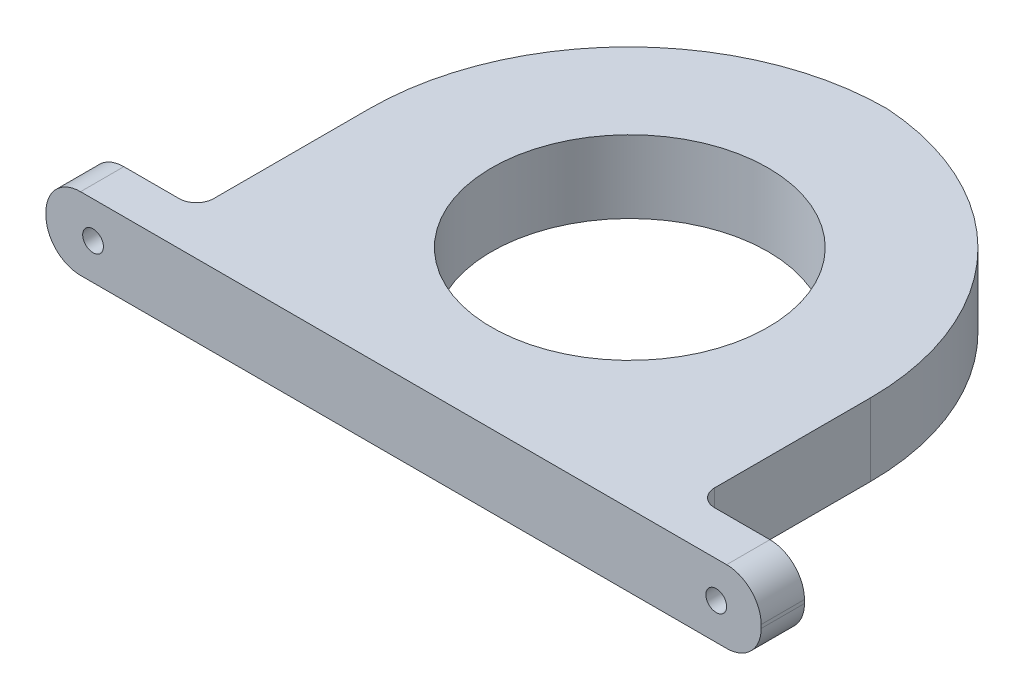
ISO-10303-21;
HEADER;
FILE_DESCRIPTION(('STEP AP214'),'2;1');
FILE_NAME('part.step','',(''),(''),'','','');
FILE_SCHEMA(('AUTOMOTIVE_DESIGN { 1 0 10303 214 1 1 1 1 }'));
ENDSEC;
DATA;
#1=APPLICATION_CONTEXT('core data for automotive mechanical design processes');
#2=APPLICATION_PROTOCOL_DEFINITION('international standard','automotive_design',2000,#1);
#3=PRODUCT_CONTEXT('',#1,'mechanical');
#4=PRODUCT('Part','Part','',(#3));
#5=PRODUCT_RELATED_PRODUCT_CATEGORY('part','',(#4));
#6=PRODUCT_DEFINITION_FORMATION('','',#4);
#7=PRODUCT_DEFINITION_CONTEXT('part definition',#1,'design');
#8=PRODUCT_DEFINITION('design','',#6,#7);
#9=PRODUCT_DEFINITION_SHAPE('','',#8);
#10=(LENGTH_UNIT() NAMED_UNIT(*) SI_UNIT(.MILLI.,.METRE.));
#11=(NAMED_UNIT(*) PLANE_ANGLE_UNIT() SI_UNIT($,.RADIAN.));
#12=(NAMED_UNIT(*) SI_UNIT($,.STERADIAN.) SOLID_ANGLE_UNIT());
#13=UNCERTAINTY_MEASURE_WITH_UNIT(LENGTH_MEASURE(1.E-05),#10,'distance_accuracy_value','');
#14=(GEOMETRIC_REPRESENTATION_CONTEXT(3) GLOBAL_UNCERTAINTY_ASSIGNED_CONTEXT((#13)) GLOBAL_UNIT_ASSIGNED_CONTEXT((#10,
#11,#12)) REPRESENTATION_CONTEXT('',''));
#15=CARTESIAN_POINT('',(0.,0.,0.));
#16=DIRECTION('',(0.,0.,1.));
#17=DIRECTION('',(1.,0.,0.));
#18=AXIS2_PLACEMENT_3D('',#15,#16,#17);
#19=CARTESIAN_POINT('',(0.,21.,0.));
#20=DIRECTION('',(0.,1.,0.));
#21=DIRECTION('',(0.,0.,1.));
#22=AXIS2_PLACEMENT_3D('',#19,#20,#21);
#23=PLANE('',#22);
#24=DIRECTION('',(0.,0.,-1.));
#25=VECTOR('',#24,1.);
#26=CARTESIAN_POINT('',(72.1911502974414,21.,40.));
#27=LINE('',#26,#25);
#28=CARTESIAN_POINT('',(72.1911502974414,21.,35.));
#29=VERTEX_POINT('',#28);
#30=CARTESIAN_POINT('',(72.1911502974414,21.,-10.1668522645212));
#31=VERTEX_POINT('',#30);
#32=EDGE_CURVE('E264',#29,#31,#27,.T.);
#33=ORIENTED_EDGE('',*,*,#32,.T.);
#34=CARTESIAN_POINT('',(-2.80884970255862,21.,-10.1668522645212));
#35=DIRECTION('',(0.,1.,0.));
#36=DIRECTION('',(0.,0.,1.));
#37=AXIS2_PLACEMENT_3D('',#34,#35,#36);
#38=CIRCLE('',#37,75.);
#39=CARTESIAN_POINT('',(2.19115029744135,21.,-85.));
#40=VERTEX_POINT('',#39);
#41=EDGE_CURVE('E11',#31,#40,#38,.T.);
#42=ORIENTED_EDGE('',*,*,#41,.T.);
#43=CARTESIAN_POINT('',(2.19115029744135,21.,-10.));
#44=DIRECTION('',(0.,1.,0.));
#45=DIRECTION('',(0.,0.,1.));
#46=AXIS2_PLACEMENT_3D('',#43,#44,#45);
#47=CIRCLE('',#46,75.);
#48=CARTESIAN_POINT('',(-72.8088497025586,21.,-10.));
#49=VERTEX_POINT('',#48);
#50=EDGE_CURVE('E234',#40,#49,#47,.T.);
#51=ORIENTED_EDGE('',*,*,#50,.T.);
#52=DIRECTION('',(0.,0.,1.));
#53=VECTOR('',#52,1.);
#54=CARTESIAN_POINT('',(-72.8088497025586,21.,40.));
#55=LINE('',#54,#53);
#56=CARTESIAN_POINT('',(-72.8088497025586,21.,35.));
#57=VERTEX_POINT('',#56);
#58=EDGE_CURVE('E238',#49,#57,#55,.T.);
#59=ORIENTED_EDGE('',*,*,#58,.T.);
#60=CARTESIAN_POINT('',(-77.8088497025586,21.,35.));
#61=DIRECTION('',(0.,1.,0.));
#62=DIRECTION('',(0.,0.,1.));
#63=AXIS2_PLACEMENT_3D('',#60,#61,#62);
#64=CIRCLE('',#63,5.);
#65=CARTESIAN_POINT('',(-77.8088497025586,21.,40.));
#66=VERTEX_POINT('',#65);
#67=EDGE_CURVE('E224',#57,#66,#64,.F.);
#68=ORIENTED_EDGE('',*,*,#67,.T.);
#69=DIRECTION('',(-1.,0.,0.));
#70=VECTOR('',#69,1.);
#71=CARTESIAN_POINT('',(-103.808849702559,21.,40.));
#72=LINE('',#71,#70);
#73=CARTESIAN_POINT('',(-93.8088497025586,21.,40.));
#74=VERTEX_POINT('',#73);
#75=EDGE_CURVE('E155',#66,#74,#72,.T.);
#76=ORIENTED_EDGE('',*,*,#75,.T.);
#77=DIRECTION('',(0.,0.,1.));
#78=VECTOR('',#77,1.);
#79=CARTESIAN_POINT('',(-93.8088497025586,21.,52.5349418717824));
#80=LINE('',#79,#78);
#81=CARTESIAN_POINT('',(-93.8088497025586,21.,52.5349418717824));
#82=VERTEX_POINT('',#81);
#83=EDGE_CURVE('E152',#74,#82,#80,.T.);
#84=ORIENTED_EDGE('',*,*,#83,.T.);
#85=DIRECTION('',(1.,0.,0.));
#86=VECTOR('',#85,1.);
#87=CARTESIAN_POINT('',(0.191150297441383,21.,52.5349418717824));
#88=LINE('',#87,#86);
#89=CARTESIAN_POINT('',(93.1911502974413,21.,52.5349418717824));
#90=VERTEX_POINT('',#89);
#91=EDGE_CURVE('E144',#82,#90,#88,.T.);
#92=ORIENTED_EDGE('',*,*,#91,.T.);
#93=DIRECTION('',(0.,0.,-1.));
#94=VECTOR('',#93,1.);
#95=CARTESIAN_POINT('',(93.1911502974414,21.,40.));
#96=LINE('',#95,#94);
#97=CARTESIAN_POINT('',(93.1911502974414,21.,40.));
#98=VERTEX_POINT('',#97);
#99=EDGE_CURVE('E149',#90,#98,#96,.T.);
#100=ORIENTED_EDGE('',*,*,#99,.T.);
#101=DIRECTION('',(-1.,0.,0.));
#102=VECTOR('',#101,1.);
#103=CARTESIAN_POINT('',(103.191150297441,21.,40.));
#104=LINE('',#103,#102);
#105=CARTESIAN_POINT('',(77.1911502974414,21.,40.));
#106=VERTEX_POINT('',#105);
#107=EDGE_CURVE('E154',#98,#106,#104,.T.);
#108=ORIENTED_EDGE('',*,*,#107,.T.);
#109=CARTESIAN_POINT('',(77.1911502974414,21.,35.));
#110=DIRECTION('',(0.,1.,0.));
#111=DIRECTION('',(0.,0.,1.));
#112=AXIS2_PLACEMENT_3D('',#109,#110,#111);
#113=CIRCLE('',#112,5.);
#114=EDGE_CURVE('E213',#106,#29,#113,.F.);
#115=ORIENTED_EDGE('',*,*,#114,.T.);
#116=EDGE_LOOP('',(#33,#42,#51,#59,#68,#76,#84,#92,#100,#108,#115));
#117=FACE_BOUND('',#116,.T.);
#118=CARTESIAN_POINT('',(-0.308849702558636,21.,-12.9463844797178));
#119=DIRECTION('',(0.,1.,0.));
#120=DIRECTION('',(0.,0.,1.));
#121=AXIS2_PLACEMENT_3D('',#118,#119,#120);
#122=CIRCLE('',#121,40.);
#123=CARTESIAN_POINT('',(-0.308849702558636,21.,-52.9463844797178));
#124=VERTEX_POINT('',#123);
#125=EDGE_CURVE('E256',#124,#124,#122,.T.);
#126=ORIENTED_EDGE('',*,*,#125,.F.);
#127=EDGE_LOOP('',(#126));
#128=FACE_BOUND('',#127,.T.);
#129=ADVANCED_FACE('F36',(#117,#128),#23,.T.);
#130=CARTESIAN_POINT('',(0.,0.,0.));
#131=DIRECTION('',(0.,1.,0.));
#132=DIRECTION('',(0.,0.,1.));
#133=AXIS2_PLACEMENT_3D('',#130,#131,#132);
#134=PLANE('',#133);
#135=CARTESIAN_POINT('',(2.19115029744135,0.,-10.));
#136=DIRECTION('',(0.,1.,0.));
#137=DIRECTION('',(0.,0.,1.));
#138=AXIS2_PLACEMENT_3D('',#135,#136,#137);
#139=CIRCLE('',#138,75.);
#140=CARTESIAN_POINT('',(-72.8088497025586,0.,-10.));
#141=VERTEX_POINT('',#140);
#142=CARTESIAN_POINT('',(2.19115029744135,0.,-85.));
#143=VERTEX_POINT('',#142);
#144=EDGE_CURVE('E229',#141,#143,#139,.F.);
#145=ORIENTED_EDGE('',*,*,#144,.T.);
#146=CARTESIAN_POINT('',(-2.80884970255862,0.,-10.1668522645212));
#147=DIRECTION('',(0.,1.,0.));
#148=DIRECTION('',(0.,0.,1.));
#149=AXIS2_PLACEMENT_3D('',#146,#147,#148);
#150=CIRCLE('',#149,75.);
#151=CARTESIAN_POINT('',(72.1911502974414,0.,-10.1668522645212));
#152=VERTEX_POINT('',#151);
#153=EDGE_CURVE('E58',#143,#152,#150,.F.);
#154=ORIENTED_EDGE('',*,*,#153,.T.);
#155=DIRECTION('',(0.,0.,-1.));
#156=VECTOR('',#155,1.);
#157=CARTESIAN_POINT('',(72.1911502974414,0.,40.));
#158=LINE('',#157,#156);
#159=CARTESIAN_POINT('',(72.1911502974414,0.,35.));
#160=VERTEX_POINT('',#159);
#161=EDGE_CURVE('E248',#160,#152,#158,.T.);
#162=ORIENTED_EDGE('',*,*,#161,.F.);
#163=CARTESIAN_POINT('',(77.1911502974414,0.,35.));
#164=DIRECTION('',(0.,1.,0.));
#165=DIRECTION('',(0.,0.,1.));
#166=AXIS2_PLACEMENT_3D('',#163,#164,#165);
#167=CIRCLE('',#166,5.);
#168=CARTESIAN_POINT('',(77.1911502974414,0.,40.));
#169=VERTEX_POINT('',#168);
#170=EDGE_CURVE('E211',#160,#169,#167,.T.);
#171=ORIENTED_EDGE('',*,*,#170,.T.);
#172=DIRECTION('',(-1.,0.,0.));
#173=VECTOR('',#172,1.);
#174=CARTESIAN_POINT('',(103.191150297441,0.,40.));
#175=LINE('',#174,#173);
#176=CARTESIAN_POINT('',(93.1911502974414,0.,40.));
#177=VERTEX_POINT('',#176);
#178=EDGE_CURVE('E268',#177,#169,#175,.T.);
#179=ORIENTED_EDGE('',*,*,#178,.F.);
#180=DIRECTION('',(0.,0.,-1.));
#181=VECTOR('',#180,1.);
#182=CARTESIAN_POINT('',(93.1911502974414,0.,0.));
#183=LINE('',#182,#181);
#184=CARTESIAN_POINT('',(93.1911502974413,0.,52.5349418717824));
#185=VERTEX_POINT('',#184);
#186=EDGE_CURVE('E202',#177,#185,#183,.F.);
#187=ORIENTED_EDGE('',*,*,#186,.T.);
#188=DIRECTION('',(1.,0.,0.));
#189=VECTOR('',#188,1.);
#190=CARTESIAN_POINT('',(0.191150297441383,0.,52.5349418717824));
#191=LINE('',#190,#189);
#192=CARTESIAN_POINT('',(-93.8088497025586,0.,52.5349418717824));
#193=VERTEX_POINT('',#192);
#194=EDGE_CURVE('E258',#193,#185,#191,.T.);
#195=ORIENTED_EDGE('',*,*,#194,.F.);
#196=DIRECTION('',(0.,0.,1.));
#197=VECTOR('',#196,1.);
#198=CARTESIAN_POINT('',(-93.8088497025587,0.,1.03858424233933E-13));
#199=LINE('',#198,#197);
#200=CARTESIAN_POINT('',(-93.8088497025586,0.,40.));
#201=VERTEX_POINT('',#200);
#202=EDGE_CURVE('E192',#193,#201,#199,.F.);
#203=ORIENTED_EDGE('',*,*,#202,.T.);
#204=DIRECTION('',(-1.,0.,0.));
#205=VECTOR('',#204,1.);
#206=CARTESIAN_POINT('',(-103.808849702559,0.,40.));
#207=LINE('',#206,#205);
#208=CARTESIAN_POINT('',(-77.8088497025586,0.,40.));
#209=VERTEX_POINT('',#208);
#210=EDGE_CURVE('E255',#209,#201,#207,.T.);
#211=ORIENTED_EDGE('',*,*,#210,.F.);
#212=CARTESIAN_POINT('',(-77.8088497025586,0.,35.));
#213=DIRECTION('',(0.,1.,0.));
#214=DIRECTION('',(0.,0.,1.));
#215=AXIS2_PLACEMENT_3D('',#212,#213,#214);
#216=CIRCLE('',#215,5.);
#217=CARTESIAN_POINT('',(-72.8088497025586,0.,35.));
#218=VERTEX_POINT('',#217);
#219=EDGE_CURVE('E221',#209,#218,#216,.T.);
#220=ORIENTED_EDGE('',*,*,#219,.T.);
#221=DIRECTION('',(0.,0.,1.));
#222=VECTOR('',#221,1.);
#223=CARTESIAN_POINT('',(-72.8088497025586,0.,40.));
#224=LINE('',#223,#222);
#225=EDGE_CURVE('E253',#141,#218,#224,.T.);
#226=ORIENTED_EDGE('',*,*,#225,.F.);
#227=EDGE_LOOP('',(#145,#154,#162,#171,#179,#187,#195,#203,#211,#220,#226));
#228=FACE_BOUND('',#227,.T.);
#229=CARTESIAN_POINT('',(-0.308849702558636,0.,-12.9463844797178));
#230=DIRECTION('',(0.,1.,0.));
#231=DIRECTION('',(0.,0.,1.));
#232=AXIS2_PLACEMENT_3D('',#229,#230,#231);
#233=CIRCLE('',#232,40.);
#234=CARTESIAN_POINT('',(-0.308849702558636,0.,-52.9463844797178));
#235=VERTEX_POINT('',#234);
#236=EDGE_CURVE('E261',#235,#235,#233,.T.);
#237=ORIENTED_EDGE('',*,*,#236,.T.);
#238=EDGE_LOOP('',(#237));
#239=FACE_BOUND('',#238,.T.);
#240=ADVANCED_FACE('F251',(#228,#239),#134,.F.);
#241=CARTESIAN_POINT('',(-72.8088497025586,21.,40.));
#242=DIRECTION('',(1.,0.,0.));
#243=DIRECTION('',(0.,0.,-1.));
#244=AXIS2_PLACEMENT_3D('',#241,#242,#243);
#245=PLANE('',#244);
#246=ORIENTED_EDGE('',*,*,#58,.F.);
#247=DIRECTION('',(0.,-1.,0.));
#248=VECTOR('',#247,1.);
#249=CARTESIAN_POINT('',(-72.8088497025586,21.,-10.));
#250=LINE('',#249,#248);
#251=EDGE_CURVE('E226',#49,#141,#250,.T.);
#252=ORIENTED_EDGE('',*,*,#251,.T.);
#253=ORIENTED_EDGE('',*,*,#225,.T.);
#254=DIRECTION('',(0.,-1.,0.));
#255=VECTOR('',#254,1.);
#256=CARTESIAN_POINT('',(-72.8088497025586,21.,35.));
#257=LINE('',#256,#255);
#258=EDGE_CURVE('E218',#218,#57,#257,.F.);
#259=ORIENTED_EDGE('',*,*,#258,.T.);
#260=EDGE_LOOP('',(#246,#252,#253,#259));
#261=FACE_BOUND('',#260,.T.);
#262=ADVANCED_FACE('F244',(#261),#245,.F.);
#263=CARTESIAN_POINT('',(-103.808849702559,21.,40.));
#264=DIRECTION('',(0.,0.,1.));
#265=DIRECTION('',(1.,0.,0.));
#266=AXIS2_PLACEMENT_3D('',#263,#264,#265);
#267=PLANE('',#266);
#268=CARTESIAN_POINT('',(-90.1911502974413,10.5,40.));
#269=DIRECTION('',(0.,0.,-1.));
#270=DIRECTION('',(1.,0.,0.));
#271=AXIS2_PLACEMENT_3D('',#268,#269,#270);
#272=CIRCLE('',#271,3.00000000000001);
#273=CARTESIAN_POINT('',(-87.1911502974413,10.5,40.));
#274=VERTEX_POINT('',#273);
#275=EDGE_CURVE('E312',#274,#274,#272,.T.);
#276=ORIENTED_EDGE('',*,*,#275,.F.);
#277=EDGE_LOOP('',(#276));
#278=FACE_BOUND('',#277,.T.);
#279=ORIENTED_EDGE('',*,*,#75,.F.);
#280=DIRECTION('',(0.,-1.,0.));
#281=VECTOR('',#280,1.);
#282=CARTESIAN_POINT('',(-77.8088497025586,0.,40.));
#283=LINE('',#282,#281);
#284=EDGE_CURVE('E215',#66,#209,#283,.T.);
#285=ORIENTED_EDGE('',*,*,#284,.T.);
#286=ORIENTED_EDGE('',*,*,#210,.T.);
#287=CARTESIAN_POINT('',(-93.8088497025586,10.,40.));
#288=DIRECTION('',(0.,0.,1.));
#289=DIRECTION('',(1.,0.,0.));
#290=AXIS2_PLACEMENT_3D('',#287,#288,#289);
#291=CIRCLE('',#290,10.);
#292=CARTESIAN_POINT('',(-103.808849702559,10.,40.));
#293=VERTEX_POINT('',#292);
#294=EDGE_CURVE('E195',#201,#293,#291,.F.);
#295=ORIENTED_EDGE('',*,*,#294,.T.);
#296=DIRECTION('',(0.,-1.,0.));
#297=VECTOR('',#296,1.);
#298=CARTESIAN_POINT('',(-103.808849702559,21.,40.));
#299=LINE('',#298,#297);
#300=CARTESIAN_POINT('',(-103.808849702559,11.,40.));
#301=VERTEX_POINT('',#300);
#302=EDGE_CURVE('E170',#301,#293,#299,.T.);
#303=ORIENTED_EDGE('',*,*,#302,.F.);
#304=CARTESIAN_POINT('',(-93.8088497025586,11.,40.));
#305=DIRECTION('',(0.,0.,1.));
#306=DIRECTION('',(1.,0.,0.));
#307=AXIS2_PLACEMENT_3D('',#304,#305,#306);
#308=CIRCLE('',#307,10.);
#309=EDGE_CURVE('E184',#301,#74,#308,.F.);
#310=ORIENTED_EDGE('',*,*,#309,.T.);
#311=EDGE_LOOP('',(#279,#285,#286,#295,#303,#310));
#312=FACE_BOUND('',#311,.T.);
#313=ADVANCED_FACE('F288',(#278,#312),#267,.F.);
#314=CARTESIAN_POINT('',(-103.808849702559,21.,52.5349418717824));
#315=DIRECTION('',(1.,0.,0.));
#316=DIRECTION('',(0.,0.,-1.));
#317=AXIS2_PLACEMENT_3D('',#314,#315,#316);
#318=PLANE('',#317);
#319=ORIENTED_EDGE('',*,*,#302,.T.);
#320=DIRECTION('',(0.,0.,1.));
#321=VECTOR('',#320,1.);
#322=CARTESIAN_POINT('',(-103.808849702559,10.,52.5349418717824));
#323=LINE('',#322,#321);
#324=CARTESIAN_POINT('',(-103.808849702559,10.,52.5349418717824));
#325=VERTEX_POINT('',#324);
#326=EDGE_CURVE('E187',#293,#325,#323,.T.);
#327=ORIENTED_EDGE('',*,*,#326,.T.);
#328=DIRECTION('',(0.,-1.,0.));
#329=VECTOR('',#328,1.);
#330=CARTESIAN_POINT('',(-103.808849702559,21.,52.5349418717824));
#331=LINE('',#330,#329);
#332=CARTESIAN_POINT('',(-103.808849702559,11.,52.5349418717824));
#333=VERTEX_POINT('',#332);
#334=EDGE_CURVE('E174',#333,#325,#331,.T.);
#335=ORIENTED_EDGE('',*,*,#334,.F.);
#336=DIRECTION('',(0.,0.,1.));
#337=VECTOR('',#336,1.);
#338=CARTESIAN_POINT('',(-103.808849702559,11.,40.));
#339=LINE('',#338,#337);
#340=EDGE_CURVE('E182',#333,#301,#339,.F.);
#341=ORIENTED_EDGE('',*,*,#340,.T.);
#342=EDGE_LOOP('',(#319,#327,#335,#341));
#343=FACE_BOUND('',#342,.T.);
#344=ADVANCED_FACE('F280',(#343),#318,.F.);
#345=CARTESIAN_POINT('',(0.191150297441383,21.,52.5349418717824));
#346=DIRECTION('',(0.,0.,-1.));
#347=DIRECTION('',(-1.,0.,0.));
#348=AXIS2_PLACEMENT_3D('',#345,#346,#347);
#349=PLANE('',#348);
#350=CARTESIAN_POINT('',(90.1911502974414,10.5,52.5349418717825));
#351=DIRECTION('',(0.,0.,-1.));
#352=DIRECTION('',(-1.,0.,0.));
#353=AXIS2_PLACEMENT_3D('',#350,#351,#352);
#354=CIRCLE('',#353,3.00000000000001);
#355=CARTESIAN_POINT('',(87.1911502974414,10.5,52.5349418717825));
#356=VERTEX_POINT('',#355);
#357=EDGE_CURVE('E310',#356,#356,#354,.T.);
#358=ORIENTED_EDGE('',*,*,#357,.T.);
#359=EDGE_LOOP('',(#358));
#360=FACE_BOUND('',#359,.T.);
#361=CARTESIAN_POINT('',(-90.1911502974413,10.5,52.5349418717825));
#362=DIRECTION('',(0.,0.,-1.));
#363=DIRECTION('',(1.,0.,0.));
#364=AXIS2_PLACEMENT_3D('',#361,#362,#363);
#365=CIRCLE('',#364,3.00000000000001);
#366=CARTESIAN_POINT('',(-87.1911502974413,10.5,52.5349418717825));
#367=VERTEX_POINT('',#366);
#368=EDGE_CURVE('E315',#367,#367,#365,.T.);
#369=ORIENTED_EDGE('',*,*,#368,.T.);
#370=EDGE_LOOP('',(#369));
#371=FACE_BOUND('',#370,.T.);
#372=ORIENTED_EDGE('',*,*,#194,.T.);
#373=CARTESIAN_POINT('',(93.1911502974414,10.,52.5349418717824));
#374=DIRECTION('',(0.,0.,-1.));
#375=DIRECTION('',(-1.,0.,0.));
#376=AXIS2_PLACEMENT_3D('',#373,#374,#375);
#377=CIRCLE('',#376,10.);
#378=CARTESIAN_POINT('',(103.191150297441,10.,52.5349418717824));
#379=VERTEX_POINT('',#378);
#380=EDGE_CURVE('E204',#185,#379,#377,.F.);
#381=ORIENTED_EDGE('',*,*,#380,.T.);
#382=DIRECTION('',(0.,-1.,0.));
#383=VECTOR('',#382,1.);
#384=CARTESIAN_POINT('',(103.191150297441,21.,52.5349418717824));
#385=LINE('',#384,#383);
#386=CARTESIAN_POINT('',(103.191150297441,11.,52.5349418717824));
#387=VERTEX_POINT('',#386);
#388=EDGE_CURVE('E163',#387,#379,#385,.T.);
#389=ORIENTED_EDGE('',*,*,#388,.F.);
#390=CARTESIAN_POINT('',(93.1911502974414,11.,52.5349418717824));
#391=DIRECTION('',(0.,0.,-1.));
#392=DIRECTION('',(-1.,0.,0.));
#393=AXIS2_PLACEMENT_3D('',#390,#391,#392);
#394=CIRCLE('',#393,10.);
#395=EDGE_CURVE('E159',#387,#90,#394,.F.);
#396=ORIENTED_EDGE('',*,*,#395,.T.);
#397=ORIENTED_EDGE('',*,*,#91,.F.);
#398=CARTESIAN_POINT('',(-93.8088497025586,11.,52.5349418717824));
#399=DIRECTION('',(0.,0.,-1.));
#400=DIRECTION('',(-1.,0.,0.));
#401=AXIS2_PLACEMENT_3D('',#398,#399,#400);
#402=CIRCLE('',#401,10.);
#403=EDGE_CURVE('E180',#82,#333,#402,.F.);
#404=ORIENTED_EDGE('',*,*,#403,.T.);
#405=ORIENTED_EDGE('',*,*,#334,.T.);
#406=CARTESIAN_POINT('',(-93.8088497025586,10.,52.5349418717824));
#407=DIRECTION('',(0.,0.,-1.));
#408=DIRECTION('',(-1.,0.,0.));
#409=AXIS2_PLACEMENT_3D('',#406,#407,#408);
#410=CIRCLE('',#409,10.);
#411=EDGE_CURVE('E190',#325,#193,#410,.F.);
#412=ORIENTED_EDGE('',*,*,#411,.T.);
#413=EDGE_LOOP('',(#372,#381,#389,#396,#397,#404,#405,#412));
#414=FACE_BOUND('',#413,.T.);
#415=ADVANCED_FACE('F161',(#360,#371,#414),#349,.F.);
#416=CARTESIAN_POINT('',(103.191150297441,21.,52.5349418717824));
#417=DIRECTION('',(-1.,0.,0.));
#418=DIRECTION('',(0.,0.,1.));
#419=AXIS2_PLACEMENT_3D('',#416,#417,#418);
#420=PLANE('',#419);
#421=ORIENTED_EDGE('',*,*,#388,.T.);
#422=DIRECTION('',(0.,0.,-1.));
#423=VECTOR('',#422,1.);
#424=CARTESIAN_POINT('',(103.191150297441,10.,52.5349418717824));
#425=LINE('',#424,#423);
#426=CARTESIAN_POINT('',(103.191150297441,10.,40.));
#427=VERTEX_POINT('',#426);
#428=EDGE_CURVE('E197',#379,#427,#425,.T.);
#429=ORIENTED_EDGE('',*,*,#428,.T.);
#430=DIRECTION('',(0.,-1.,0.));
#431=VECTOR('',#430,1.);
#432=CARTESIAN_POINT('',(103.191150297441,21.,40.));
#433=LINE('',#432,#431);
#434=CARTESIAN_POINT('',(103.191150297441,11.,40.));
#435=VERTEX_POINT('',#434);
#436=EDGE_CURVE('E272',#435,#427,#433,.T.);
#437=ORIENTED_EDGE('',*,*,#436,.F.);
#438=DIRECTION('',(0.,0.,-1.));
#439=VECTOR('',#438,1.);
#440=CARTESIAN_POINT('',(103.191150297441,11.,52.5349418717824));
#441=LINE('',#440,#439);
#442=EDGE_CURVE('E166',#435,#387,#441,.F.);
#443=ORIENTED_EDGE('',*,*,#442,.T.);
#444=EDGE_LOOP('',(#421,#429,#437,#443));
#445=FACE_BOUND('',#444,.T.);
#446=ADVANCED_FACE('F302',(#445),#420,.F.);
#447=CARTESIAN_POINT('',(103.191150297441,21.,40.));
#448=DIRECTION('',(0.,0.,1.));
#449=DIRECTION('',(1.,0.,0.));
#450=AXIS2_PLACEMENT_3D('',#447,#448,#449);
#451=PLANE('',#450);
#452=CARTESIAN_POINT('',(90.1911502974414,10.5,40.));
#453=DIRECTION('',(0.,0.,-1.));
#454=DIRECTION('',(-1.,0.,0.));
#455=AXIS2_PLACEMENT_3D('',#452,#453,#454);
#456=CIRCLE('',#455,3.00000000000001);
#457=CARTESIAN_POINT('',(87.1911502974414,10.5,40.));
#458=VERTEX_POINT('',#457);
#459=EDGE_CURVE('E318',#458,#458,#456,.T.);
#460=ORIENTED_EDGE('',*,*,#459,.F.);
#461=EDGE_LOOP('',(#460));
#462=FACE_BOUND('',#461,.T.);
#463=ORIENTED_EDGE('',*,*,#178,.T.);
#464=DIRECTION('',(0.,-1.,0.));
#465=VECTOR('',#464,1.);
#466=CARTESIAN_POINT('',(77.1911502974414,21.,40.));
#467=LINE('',#466,#465);
#468=EDGE_CURVE('E209',#169,#106,#467,.F.);
#469=ORIENTED_EDGE('',*,*,#468,.T.);
#470=ORIENTED_EDGE('',*,*,#107,.F.);
#471=CARTESIAN_POINT('',(93.1911502974414,11.,40.));
#472=DIRECTION('',(0.,0.,1.));
#473=DIRECTION('',(1.,0.,0.));
#474=AXIS2_PLACEMENT_3D('',#471,#472,#473);
#475=CIRCLE('',#474,10.);
#476=EDGE_CURVE('E169',#98,#435,#475,.F.);
#477=ORIENTED_EDGE('',*,*,#476,.T.);
#478=ORIENTED_EDGE('',*,*,#436,.T.);
#479=CARTESIAN_POINT('',(93.1911502974414,10.,40.));
#480=DIRECTION('',(0.,0.,1.));
#481=DIRECTION('',(1.,0.,0.));
#482=AXIS2_PLACEMENT_3D('',#479,#480,#481);
#483=CIRCLE('',#482,10.);
#484=EDGE_CURVE('E200',#427,#177,#483,.F.);
#485=ORIENTED_EDGE('',*,*,#484,.T.);
#486=EDGE_LOOP('',(#463,#469,#470,#477,#478,#485));
#487=FACE_BOUND('',#486,.T.);
#488=ADVANCED_FACE('F304',(#462,#487),#451,.F.);
#489=CARTESIAN_POINT('',(72.1911502974414,21.,40.));
#490=DIRECTION('',(-1.,0.,0.));
#491=DIRECTION('',(0.,0.,1.));
#492=AXIS2_PLACEMENT_3D('',#489,#490,#491);
#493=PLANE('',#492);
#494=ORIENTED_EDGE('',*,*,#161,.T.);
#495=DIRECTION('',(0.,-1.,0.));
#496=VECTOR('',#495,1.);
#497=CARTESIAN_POINT('',(72.1911502974414,21.,-10.1668522645212));
#498=LINE('',#497,#496);
#499=EDGE_CURVE('E44',#152,#31,#498,.F.);
#500=ORIENTED_EDGE('',*,*,#499,.T.);
#501=ORIENTED_EDGE('',*,*,#32,.F.);
#502=DIRECTION('',(0.,-1.,0.));
#503=VECTOR('',#502,1.);
#504=CARTESIAN_POINT('',(72.1911502974414,0.,35.));
#505=LINE('',#504,#503);
#506=EDGE_CURVE('E206',#29,#160,#505,.T.);
#507=ORIENTED_EDGE('',*,*,#506,.T.);
#508=EDGE_LOOP('',(#494,#500,#501,#507));
#509=FACE_BOUND('',#508,.T.);
#510=ADVANCED_FACE('F334',(#509),#493,.F.);
#511=CARTESIAN_POINT('',(-0.308849702558636,21.,-12.9463844797178));
#512=DIRECTION('',(0.,-1.,0.));
#513=DIRECTION('',(0.,0.,-1.));
#514=AXIS2_PLACEMENT_3D('',#511,#512,#513);
#515=CYLINDRICAL_SURFACE('',#514,40.);
#516=CARTESIAN_POINT('',(-0.308849702558636,21.,-52.9463844797178));
#517=CARTESIAN_POINT('',(-0.308849702558636,20.78125,-52.9463844797178));
#518=CARTESIAN_POINT('',(-0.308849702558636,20.5625,-52.9463844797178));
#519=CARTESIAN_POINT('',(-0.308849702558636,20.125,-52.9463844797178));
#520=CARTESIAN_POINT('',(-0.308849702558636,19.90625,-52.9463844797178));
#521=CARTESIAN_POINT('',(-0.308849702558636,19.46875,-52.9463844797178));
#522=CARTESIAN_POINT('',(-0.308849702558636,19.25,-52.9463844797178));
#523=CARTESIAN_POINT('',(-0.308849702558636,18.8125,-52.9463844797178));
#524=CARTESIAN_POINT('',(-0.308849702558636,18.59375,-52.9463844797178));
#525=CARTESIAN_POINT('',(-0.308849702558636,18.15625,-52.9463844797178));
#526=CARTESIAN_POINT('',(-0.308849702558636,17.9375,-52.9463844797178));
#527=CARTESIAN_POINT('',(-0.308849702558636,17.5,-52.9463844797178));
#528=CARTESIAN_POINT('',(-0.308849702558636,17.28125,-52.9463844797178));
#529=CARTESIAN_POINT('',(-0.308849702558636,16.84375,-52.9463844797178));
#530=CARTESIAN_POINT('',(-0.308849702558636,16.625,-52.9463844797178));
#531=CARTESIAN_POINT('',(-0.308849702558636,16.1875,-52.9463844797178));
#532=CARTESIAN_POINT('',(-0.308849702558636,15.96875,-52.9463844797178));
#533=CARTESIAN_POINT('',(-0.308849702558636,15.53125,-52.9463844797178));
#534=CARTESIAN_POINT('',(-0.308849702558636,15.3125,-52.9463844797178));
#535=CARTESIAN_POINT('',(-0.308849702558636,14.875,-52.9463844797178));
#536=CARTESIAN_POINT('',(-0.308849702558636,14.65625,-52.9463844797178));
#537=CARTESIAN_POINT('',(-0.308849702558636,14.21875,-52.9463844797178));
#538=CARTESIAN_POINT('',(-0.308849702558636,14.,-52.9463844797178));
#539=CARTESIAN_POINT('',(-0.308849702558636,13.5625,-52.9463844797178));
#540=CARTESIAN_POINT('',(-0.308849702558636,13.34375,-52.9463844797178));
#541=CARTESIAN_POINT('',(-0.308849702558636,12.90625,-52.9463844797178));
#542=CARTESIAN_POINT('',(-0.308849702558636,12.6875,-52.9463844797178));
#543=CARTESIAN_POINT('',(-0.308849702558636,12.25,-52.9463844797178));
#544=CARTESIAN_POINT('',(-0.308849702558636,12.03125,-52.9463844797178));
#545=CARTESIAN_POINT('',(-0.308849702558636,11.59375,-52.9463844797178));
#546=CARTESIAN_POINT('',(-0.308849702558636,11.375,-52.9463844797178));
#547=CARTESIAN_POINT('',(-0.308849702558636,10.9375,-52.9463844797178));
#548=CARTESIAN_POINT('',(-0.308849702558636,10.71875,-52.9463844797178));
#549=CARTESIAN_POINT('',(-0.308849702558636,10.28125,-52.9463844797178));
#550=CARTESIAN_POINT('',(-0.308849702558636,10.0625,-52.9463844797178));
#551=CARTESIAN_POINT('',(-0.308849702558636,9.625,-52.9463844797178));
#552=CARTESIAN_POINT('',(-0.308849702558636,9.40625,-52.9463844797178));
#553=CARTESIAN_POINT('',(-0.308849702558636,8.96875,-52.9463844797178));
#554=CARTESIAN_POINT('',(-0.308849702558636,8.75,-52.9463844797178));
#555=CARTESIAN_POINT('',(-0.308849702558636,8.3125,-52.9463844797178));
#556=CARTESIAN_POINT('',(-0.308849702558636,8.09375,-52.9463844797178));
#557=CARTESIAN_POINT('',(-0.308849702558636,7.65625,-52.9463844797178));
#558=CARTESIAN_POINT('',(-0.308849702558636,7.4375,-52.9463844797178));
#559=CARTESIAN_POINT('',(-0.308849702558636,7.,-52.9463844797178));
#560=CARTESIAN_POINT('',(-0.308849702558636,6.78125,-52.9463844797178));
#561=CARTESIAN_POINT('',(-0.308849702558636,6.34375,-52.9463844797178));
#562=CARTESIAN_POINT('',(-0.308849702558636,6.125,-52.9463844797178));
#563=CARTESIAN_POINT('',(-0.308849702558636,5.6875,-52.9463844797178));
#564=CARTESIAN_POINT('',(-0.308849702558636,5.46875,-52.9463844797178));
#565=CARTESIAN_POINT('',(-0.308849702558636,5.03125,-52.9463844797178));
#566=CARTESIAN_POINT('',(-0.308849702558636,4.8125,-52.9463844797178));
#567=CARTESIAN_POINT('',(-0.308849702558636,4.375,-52.9463844797178));
#568=CARTESIAN_POINT('',(-0.308849702558636,4.15625,-52.9463844797178));
#569=CARTESIAN_POINT('',(-0.308849702558636,3.71875,-52.9463844797178));
#570=CARTESIAN_POINT('',(-0.308849702558636,3.5,-52.9463844797178));
#571=CARTESIAN_POINT('',(-0.308849702558636,3.0625,-52.9463844797178));
#572=CARTESIAN_POINT('',(-0.308849702558636,2.84375,-52.9463844797178));
#573=CARTESIAN_POINT('',(-0.308849702558636,2.40625,-52.9463844797178));
#574=CARTESIAN_POINT('',(-0.308849702558636,2.1875,-52.9463844797178));
#575=CARTESIAN_POINT('',(-0.308849702558636,1.75,-52.9463844797178));
#576=CARTESIAN_POINT('',(-0.308849702558636,1.53125,-52.9463844797178));
#577=CARTESIAN_POINT('',(-0.308849702558636,1.09375,-52.9463844797178));
#578=CARTESIAN_POINT('',(-0.308849702558636,0.875000000000001,-52.9463844797178));
#579=CARTESIAN_POINT('',(-0.308849702558636,0.4375,-52.9463844797178));
#580=CARTESIAN_POINT('',(-0.308849702558636,0.21875,-52.9463844797178));
#581=CARTESIAN_POINT('',(-0.308849702558636,0.,-52.9463844797178));
#582=B_SPLINE_CURVE_WITH_KNOTS('',3,(#516,#517,#518,#519,#520,#521,#522,#523,#524,#525,#526,
#527,#528,#529,#530,#531,#532,#533,#534,#535,#536,#537,#538,#539,#540,#541,#542,#543,#544,#545,
#546,#547,#548,#549,#550,#551,#552,#553,#554,#555,#556,#557,#558,#559,#560,#561,#562,#563,#564,
#565,#566,#567,#568,#569,#570,#571,#572,#573,#574,#575,#576,#577,#578,#579,#580,#581),
.UNSPECIFIED.,.F.,.F.,(4,2,2,2,2,2,2,2,2,2,2,2,2,2,2,2,2,2,2,2,2,2,2,2,2,2,2,2,2,2,2,2,4),(0.,
0.656249999999997,1.3125,1.96875,2.625,3.28125,3.9375,4.59375,5.25,5.90625,6.5625,7.21875,7.875,
8.53125,9.1875,9.84375,10.5,11.15625,11.8125,12.46875,13.125,13.78125,14.4375,15.09375,15.75,
16.40625,17.0625,17.71875,18.375,19.03125,19.6875,20.34375,21.),.UNSPECIFIED.);
#583=EDGE_CURVE('BSEAM340',#124,#235,#582,.T.);
#584=ORIENTED_EDGE('',*,*,#125,.T.);
#585=ORIENTED_EDGE('',*,*,#236,.F.);
#586=ORIENTED_EDGE('',*,*,#583,.T.);
#587=ORIENTED_EDGE('',*,*,#583,.F.);
#588=EDGE_LOOP('',(#584,#586,#585,#587));
#589=FACE_BOUND('',#588,.T.);
#590=ADVANCED_FACE('F340',(#589),#515,.F.);
#591=CARTESIAN_POINT('',(93.1911502974414,11.,0.));
#592=DIRECTION('',(0.,0.,1.));
#593=DIRECTION('',(1.,0.,0.));
#594=AXIS2_PLACEMENT_3D('',#591,#592,#593);
#595=CYLINDRICAL_SURFACE('',#594,10.);
#596=ORIENTED_EDGE('',*,*,#395,.F.);
#597=ORIENTED_EDGE('',*,*,#442,.F.);
#598=ORIENTED_EDGE('',*,*,#476,.F.);
#599=ORIENTED_EDGE('',*,*,#99,.F.);
#600=EDGE_LOOP('',(#596,#597,#598,#599));
#601=FACE_BOUND('',#600,.T.);
#602=ADVANCED_FACE('F168',(#601),#595,.T.);
#603=CARTESIAN_POINT('',(-93.8088497025587,11.,1.03858424233933E-13));
#604=DIRECTION('',(0.,0.,-1.));
#605=DIRECTION('',(-1.,0.,0.));
#606=AXIS2_PLACEMENT_3D('',#603,#604,#605);
#607=CYLINDRICAL_SURFACE('',#606,10.);
#608=ORIENTED_EDGE('',*,*,#309,.F.);
#609=ORIENTED_EDGE('',*,*,#340,.F.);
#610=ORIENTED_EDGE('',*,*,#403,.F.);
#611=ORIENTED_EDGE('',*,*,#83,.F.);
#612=EDGE_LOOP('',(#608,#609,#610,#611));
#613=FACE_BOUND('',#612,.T.);
#614=ADVANCED_FACE('F285',(#613),#607,.T.);
#615=CARTESIAN_POINT('',(-93.8088497025586,10.,52.5349418717824));
#616=DIRECTION('',(0.,0.,1.));
#617=DIRECTION('',(1.,0.,0.));
#618=AXIS2_PLACEMENT_3D('',#615,#616,#617);
#619=CYLINDRICAL_SURFACE('',#618,10.);
#620=ORIENTED_EDGE('',*,*,#294,.F.);
#621=ORIENTED_EDGE('',*,*,#202,.F.);
#622=ORIENTED_EDGE('',*,*,#411,.F.);
#623=ORIENTED_EDGE('',*,*,#326,.F.);
#624=EDGE_LOOP('',(#620,#621,#622,#623));
#625=FACE_BOUND('',#624,.T.);
#626=ADVANCED_FACE('F292',(#625),#619,.T.);
#627=CARTESIAN_POINT('',(93.1911502974414,10.,52.5349418717824));
#628=DIRECTION('',(0.,0.,-1.));
#629=DIRECTION('',(-1.,0.,0.));
#630=AXIS2_PLACEMENT_3D('',#627,#628,#629);
#631=CYLINDRICAL_SURFACE('',#630,10.);
#632=ORIENTED_EDGE('',*,*,#380,.F.);
#633=ORIENTED_EDGE('',*,*,#186,.F.);
#634=ORIENTED_EDGE('',*,*,#484,.F.);
#635=ORIENTED_EDGE('',*,*,#428,.F.);
#636=EDGE_LOOP('',(#632,#633,#634,#635));
#637=FACE_BOUND('',#636,.T.);
#638=ADVANCED_FACE('F299',(#637),#631,.T.);
#639=CARTESIAN_POINT('',(77.1911502974414,21.,35.));
#640=DIRECTION('',(0.,1.,0.));
#641=DIRECTION('',(0.,0.,1.));
#642=AXIS2_PLACEMENT_3D('',#639,#640,#641);
#643=CYLINDRICAL_SURFACE('',#642,5.);
#644=ORIENTED_EDGE('',*,*,#114,.F.);
#645=ORIENTED_EDGE('',*,*,#468,.F.);
#646=ORIENTED_EDGE('',*,*,#170,.F.);
#647=ORIENTED_EDGE('',*,*,#506,.F.);
#648=EDGE_LOOP('',(#644,#645,#646,#647));
#649=FACE_BOUND('',#648,.T.);
#650=ADVANCED_FACE('F379',(#649),#643,.F.);
#651=CARTESIAN_POINT('',(-77.8088497025586,21.,35.));
#652=DIRECTION('',(0.,1.,0.));
#653=DIRECTION('',(0.,0.,1.));
#654=AXIS2_PLACEMENT_3D('',#651,#652,#653);
#655=CYLINDRICAL_SURFACE('',#654,5.);
#656=ORIENTED_EDGE('',*,*,#67,.F.);
#657=ORIENTED_EDGE('',*,*,#258,.F.);
#658=ORIENTED_EDGE('',*,*,#219,.F.);
#659=ORIENTED_EDGE('',*,*,#284,.F.);
#660=EDGE_LOOP('',(#656,#657,#658,#659));
#661=FACE_BOUND('',#660,.T.);
#662=ADVANCED_FACE('F382',(#661),#655,.F.);
#663=CARTESIAN_POINT('',(2.19115029744135,21.,-10.));
#664=DIRECTION('',(0.,-1.,0.));
#665=DIRECTION('',(0.,0.,-1.));
#666=AXIS2_PLACEMENT_3D('',#663,#664,#665);
#667=CYLINDRICAL_SURFACE('',#666,75.);
#668=ORIENTED_EDGE('',*,*,#50,.F.);
#669=DIRECTION('',(0.,-1.,0.));
#670=VECTOR('',#669,1.);
#671=CARTESIAN_POINT('',(2.19115029744135,21.,-85.));
#672=LINE('',#671,#670);
#673=EDGE_CURVE('E231',#143,#40,#672,.F.);
#674=ORIENTED_EDGE('',*,*,#673,.F.);
#675=ORIENTED_EDGE('',*,*,#144,.F.);
#676=ORIENTED_EDGE('',*,*,#251,.F.);
#677=EDGE_LOOP('',(#668,#674,#675,#676));
#678=FACE_BOUND('',#677,.T.);
#679=ADVANCED_FACE('F250',(#678),#667,.T.);
#680=CARTESIAN_POINT('',(-2.80884970255862,21.,-10.1668522645212));
#681=DIRECTION('',(0.,-1.,0.));
#682=DIRECTION('',(0.,0.,-1.));
#683=AXIS2_PLACEMENT_3D('',#680,#681,#682);
#684=CYLINDRICAL_SURFACE('',#683,75.);
#685=ORIENTED_EDGE('',*,*,#41,.F.);
#686=ORIENTED_EDGE('',*,*,#499,.F.);
#687=ORIENTED_EDGE('',*,*,#153,.F.);
#688=ORIENTED_EDGE('',*,*,#673,.T.);
#689=EDGE_LOOP('',(#685,#686,#687,#688));
#690=FACE_BOUND('',#689,.T.);
#691=ADVANCED_FACE('F38',(#690),#684,.T.);
#692=CARTESIAN_POINT('',(90.1911502974414,10.5,52.5349418717825));
#693=DIRECTION('',(0.,0.,-1.));
#694=DIRECTION('',(-1.,0.,0.));
#695=AXIS2_PLACEMENT_3D('',#692,#693,#694);
#696=CYLINDRICAL_SURFACE('',#695,3.00000000000001);
#697=ORIENTED_EDGE('',*,*,#357,.F.);
#698=EDGE_LOOP('',(#697));
#699=FACE_BOUND('',#698,.T.);
#700=ORIENTED_EDGE('',*,*,#459,.T.);
#701=EDGE_LOOP('',(#700));
#702=FACE_BOUND('',#701,.T.);
#703=ADVANCED_FACE('F326',(#699,#702),#696,.F.);
#704=CARTESIAN_POINT('',(-90.1911502974413,10.5,52.5349418717825));
#705=DIRECTION('',(0.,0.,-1.));
#706=DIRECTION('',(-1.,0.,0.));
#707=AXIS2_PLACEMENT_3D('',#704,#705,#706);
#708=CYLINDRICAL_SURFACE('',#707,3.00000000000001);
#709=ORIENTED_EDGE('',*,*,#368,.F.);
#710=EDGE_LOOP('',(#709));
#711=FACE_BOUND('',#710,.T.);
#712=ORIENTED_EDGE('',*,*,#275,.T.);
#713=EDGE_LOOP('',(#712));
#714=FACE_BOUND('',#713,.T.);
#715=ADVANCED_FACE('F329',(#711,#714),#708,.F.);
#716=CLOSED_SHELL('',(#129,#240,#262,#313,#344,#415,#446,#488,#510,#590,#602,#614,#626,#638,
#650,#662,#679,#691,#703,#715));
#717=MANIFOLD_SOLID_BREP('B2',#716);
#718=ADVANCED_BREP_SHAPE_REPRESENTATION('',(#18,#717),#14);
#719=SHAPE_DEFINITION_REPRESENTATION(#9,#718);
ENDSEC;
END-ISO-10303-21;
